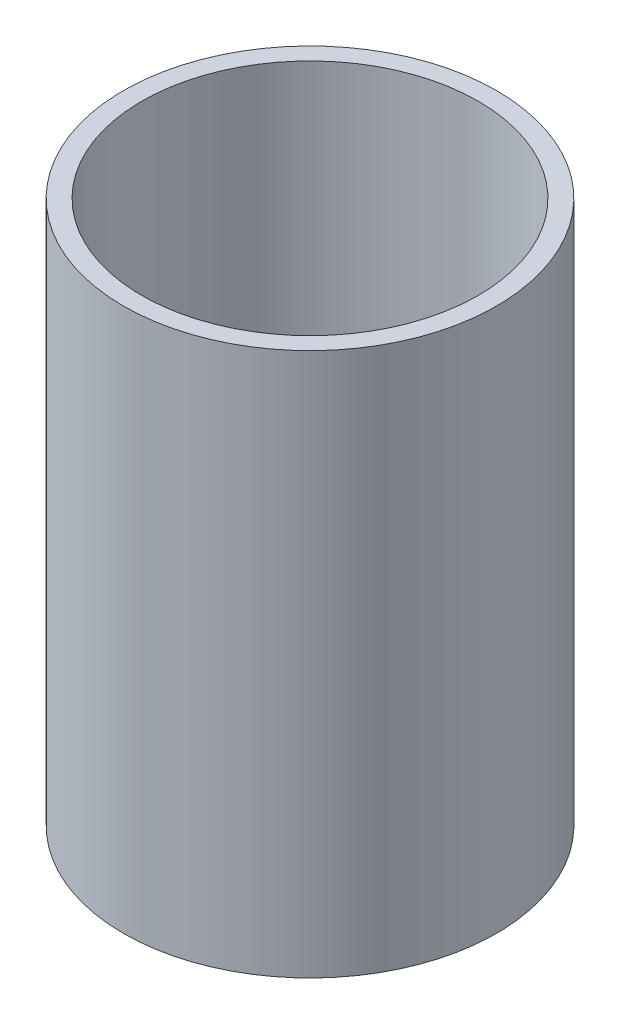
ISO-10303-21;
HEADER;
FILE_DESCRIPTION(('STEP AP214'),'2;1');
FILE_NAME('part.step','',(''),(''),'','','');
FILE_SCHEMA(('AUTOMOTIVE_DESIGN { 1 0 10303 214 1 1 1 1 }'));
ENDSEC;
DATA;
#1=APPLICATION_CONTEXT('core data for automotive mechanical design processes');
#2=APPLICATION_PROTOCOL_DEFINITION('international standard','automotive_design',2000,#1);
#3=PRODUCT_CONTEXT('',#1,'mechanical');
#4=PRODUCT('Part','Part','',(#3));
#5=PRODUCT_RELATED_PRODUCT_CATEGORY('part','',(#4));
#6=PRODUCT_DEFINITION_FORMATION('','',#4);
#7=PRODUCT_DEFINITION_CONTEXT('part definition',#1,'design');
#8=PRODUCT_DEFINITION('design','',#6,#7);
#9=PRODUCT_DEFINITION_SHAPE('','',#8);
#10=(LENGTH_UNIT() NAMED_UNIT(*) SI_UNIT(.MILLI.,.METRE.));
#11=(NAMED_UNIT(*) PLANE_ANGLE_UNIT() SI_UNIT($,.RADIAN.));
#12=(NAMED_UNIT(*) SI_UNIT($,.STERADIAN.) SOLID_ANGLE_UNIT());
#13=UNCERTAINTY_MEASURE_WITH_UNIT(LENGTH_MEASURE(1.E-05),#10,'distance_accuracy_value','');
#14=(GEOMETRIC_REPRESENTATION_CONTEXT(3) GLOBAL_UNCERTAINTY_ASSIGNED_CONTEXT((#13)) GLOBAL_UNIT_ASSIGNED_CONTEXT((#10,
#11,#12)) REPRESENTATION_CONTEXT('',''));
#15=CARTESIAN_POINT('',(0.,0.,0.));
#16=DIRECTION('',(0.,0.,1.));
#17=DIRECTION('',(1.,0.,0.));
#18=AXIS2_PLACEMENT_3D('',#15,#16,#17);
#19=CARTESIAN_POINT('',(0.,123.750590232617,0.));
#20=DIRECTION('',(0.,-1.,0.));
#21=DIRECTION('',(0.,0.,-1.));
#22=AXIS2_PLACEMENT_3D('',#19,#20,#21);
#23=CYLINDRICAL_SURFACE('',#22,42.5);
#24=CARTESIAN_POINT('',(0.,123.750590232617,0.));
#25=DIRECTION('',(0.,1.,0.));
#26=DIRECTION('',(0.,0.,1.));
#27=AXIS2_PLACEMENT_3D('',#24,#25,#26);
#28=CIRCLE('',#27,42.5);
#29=CARTESIAN_POINT('',(0.,123.750590232617,-42.5));
#30=VERTEX_POINT('',#29);
#31=EDGE_CURVE('E10',#30,#30,#28,.T.);
#32=CARTESIAN_POINT('',(0.,0.,0.));
#33=DIRECTION('',(0.,1.,0.));
#34=DIRECTION('',(0.,0.,1.));
#35=AXIS2_PLACEMENT_3D('',#32,#33,#34);
#36=CIRCLE('',#35,42.5);
#37=CARTESIAN_POINT('',(0.,0.,-42.5));
#38=VERTEX_POINT('',#37);
#39=EDGE_CURVE('E37',#38,#38,#36,.T.);
#40=CARTESIAN_POINT('',(0.,123.750590232617,-42.5));
#41=CARTESIAN_POINT('',(0.,122.461521584361,-42.5));
#42=CARTESIAN_POINT('',(0.,121.172452936104,-42.5));
#43=CARTESIAN_POINT('',(0.,118.594315639591,-42.5));
#44=CARTESIAN_POINT('',(0.,117.305246991335,-42.5));
#45=CARTESIAN_POINT('',(0.,114.727109694822,-42.5));
#46=CARTESIAN_POINT('',(0.,113.438041046566,-42.5));
#47=CARTESIAN_POINT('',(0.,110.859903750053,-42.5));
#48=CARTESIAN_POINT('',(0.,109.570835101796,-42.5));
#49=CARTESIAN_POINT('',(0.,106.992697805284,-42.5));
#50=CARTESIAN_POINT('',(0.,105.703629157027,-42.5));
#51=CARTESIAN_POINT('',(0.,103.125491860514,-42.5));
#52=CARTESIAN_POINT('',(0.,101.836423212258,-42.5));
#53=CARTESIAN_POINT('',(0.,99.258285915745,-42.5));
#54=CARTESIAN_POINT('',(0.,97.9692172674885,-42.5));
#55=CARTESIAN_POINT('',(0.,95.3910799709757,-42.5));
#56=CARTESIAN_POINT('',(0.,94.1020113227192,-42.5));
#57=CARTESIAN_POINT('',(0.,91.5238740262064,-42.5));
#58=CARTESIAN_POINT('',(0.,90.23480537795,-42.5));
#59=CARTESIAN_POINT('',(0.,87.6566680814371,-42.5));
#60=CARTESIAN_POINT('',(0.,86.3675994331807,-42.5));
#61=CARTESIAN_POINT('',(0.,83.7894621366678,-42.5));
#62=CARTESIAN_POINT('',(0.,82.5003934884114,-42.5));
#63=CARTESIAN_POINT('',(0.,79.9222561918986,-42.5));
#64=CARTESIAN_POINT('',(0.,78.6331875436421,-42.5));
#65=CARTESIAN_POINT('',(0.,76.0550502471293,-42.5));
#66=CARTESIAN_POINT('',(0.,74.7659815988728,-42.5));
#67=CARTESIAN_POINT('',(0.,72.18784430236,-42.5));
#68=CARTESIAN_POINT('',(0.,70.8987756541035,-42.5));
#69=CARTESIAN_POINT('',(0.,68.3206383575907,-42.5));
#70=CARTESIAN_POINT('',(0.,67.0315697093343,-42.5));
#71=CARTESIAN_POINT('',(0.,64.4534324128214,-42.5));
#72=CARTESIAN_POINT('',(0.,63.164363764565,-42.5));
#73=CARTESIAN_POINT('',(0.,60.5862264680521,-42.5));
#74=CARTESIAN_POINT('',(0.,59.2971578197957,-42.5));
#75=CARTESIAN_POINT('',(0.,56.7190205232828,-42.5));
#76=CARTESIAN_POINT('',(0.,55.4299518750264,-42.5));
#77=CARTESIAN_POINT('',(0.,52.8518145785136,-42.5));
#78=CARTESIAN_POINT('',(0.,51.5627459302571,-42.5));
#79=CARTESIAN_POINT('',(0.,48.9846086337443,-42.5));
#80=CARTESIAN_POINT('',(0.,47.6955399854878,-42.5));
#81=CARTESIAN_POINT('',(0.,45.117402688975,-42.5));
#82=CARTESIAN_POINT('',(0.,43.8283340407186,-42.5));
#83=CARTESIAN_POINT('',(0.,41.2501967442057,-42.5));
#84=CARTESIAN_POINT('',(0.,39.9611280959493,-42.5));
#85=CARTESIAN_POINT('',(0.,37.3829907994364,-42.5));
#86=CARTESIAN_POINT('',(0.,36.09392215118,-42.5));
#87=CARTESIAN_POINT('',(0.,33.5157848546671,-42.5));
#88=CARTESIAN_POINT('',(0.,32.2267162064107,-42.5));
#89=CARTESIAN_POINT('',(0.,29.6485789098979,-42.5));
#90=CARTESIAN_POINT('',(0.,28.3595102616414,-42.5));
#91=CARTESIAN_POINT('',(0.,25.7813729651286,-42.5));
#92=CARTESIAN_POINT('',(0.,24.4923043168721,-42.5));
#93=CARTESIAN_POINT('',(0.,21.9141670203593,-42.5));
#94=CARTESIAN_POINT('',(0.,20.6250983721028,-42.5));
#95=CARTESIAN_POINT('',(0.,18.04696107559,-42.5));
#96=CARTESIAN_POINT('',(0.,16.7578924273336,-42.5));
#97=CARTESIAN_POINT('',(0.,14.1797551308207,-42.5));
#98=CARTESIAN_POINT('',(0.,12.8906864825643,-42.5));
#99=CARTESIAN_POINT('',(0.,10.3125491860514,-42.5));
#100=CARTESIAN_POINT('',(0.,9.023480537795,-42.5));
#101=CARTESIAN_POINT('',(0.,6.44534324128214,-42.5));
#102=CARTESIAN_POINT('',(0.,5.15627459302571,-42.5));
#103=CARTESIAN_POINT('',(0.,2.57813729651286,-42.5));
#104=CARTESIAN_POINT('',(0.,1.28906864825643,-42.5));
#105=CARTESIAN_POINT('',(0.,0.,-42.5));
#106=B_SPLINE_CURVE_WITH_KNOTS('',3,(#40,#41,#42,#43,#44,#45,#46,#47,#48,#49,#50,#51,#52,#53,
#54,#55,#56,#57,#58,#59,#60,#61,#62,#63,#64,#65,#66,#67,#68,#69,#70,#71,#72,#73,#74,#75,#76,#77,
#78,#79,#80,#81,#82,#83,#84,#85,#86,#87,#88,#89,#90,#91,#92,#93,#94,#95,#96,#97,#98,#99,#100,
#101,#102,#103,#104,#105),.UNSPECIFIED.,.F.,.F.,(4,2,2,2,2,2,2,2,2,2,2,2,2,2,2,2,2,2,2,2,2,2,2,
2,2,2,2,2,2,2,2,2,4),(0.,3.86720594476929,7.73441188953858,11.6016178343079,15.4688237790771,
19.3360297238464,23.2032356686157,27.070441613385,30.9376475581543,34.8048535029236,
38.6720594476929,42.5392653924621,46.4064713372314,50.2736772820007,54.14088322677,
58.0080891715393,61.8752951163086,65.7425010610778,69.6097070058471,73.4769129506164,
77.3441188953857,81.211324840155,85.0785307849243,88.9457367296935,92.8129426744628,
96.6801486192321,100.547354564001,104.414560508771,108.28176645354,112.148972398309,
116.016178343079,119.883384287848,123.750590232617),.UNSPECIFIED.);
#107=EDGE_CURVE('BSEAM40',#30,#38,#106,.T.);
#108=ORIENTED_EDGE('',*,*,#31,.F.);
#109=ORIENTED_EDGE('',*,*,#39,.T.);
#110=ORIENTED_EDGE('',*,*,#107,.T.);
#111=ORIENTED_EDGE('',*,*,#107,.F.);
#112=EDGE_LOOP('',(#108,#110,#109,#111));
#113=FACE_BOUND('',#112,.T.);
#114=ADVANCED_FACE('F40',(#113),#23,.T.);
#115=CARTESIAN_POINT('',(0.,123.750590232617,0.));
#116=DIRECTION('',(0.,1.,0.));
#117=DIRECTION('',(0.,0.,1.));
#118=AXIS2_PLACEMENT_3D('',#115,#116,#117);
#119=PLANE('',#118);
#120=CARTESIAN_POINT('',(0.,123.750590232617,0.));
#121=DIRECTION('',(0.,1.,0.));
#122=DIRECTION('',(0.,0.,1.));
#123=AXIS2_PLACEMENT_3D('',#120,#121,#122);
#124=CIRCLE('',#123,38.3263408892088);
#125=CARTESIAN_POINT('',(0.,123.750590232617,-38.3263408892088));
#126=VERTEX_POINT('',#125);
#127=EDGE_CURVE('E50',#126,#126,#124,.T.);
#128=ORIENTED_EDGE('',*,*,#127,.F.);
#129=EDGE_LOOP('',(#128));
#130=FACE_BOUND('',#129,.T.);
#131=ORIENTED_EDGE('',*,*,#31,.T.);
#132=EDGE_LOOP('',(#131));
#133=FACE_BOUND('',#132,.T.);
#134=ADVANCED_FACE('F59',(#130,#133),#119,.T.);
#135=CARTESIAN_POINT('',(0.,0.,0.));
#136=DIRECTION('',(0.,1.,0.));
#137=DIRECTION('',(0.,0.,1.));
#138=AXIS2_PLACEMENT_3D('',#135,#136,#137);
#139=PLANE('',#138);
#140=CARTESIAN_POINT('',(0.,0.,0.));
#141=DIRECTION('',(0.,1.,0.));
#142=DIRECTION('',(0.,0.,1.));
#143=AXIS2_PLACEMENT_3D('',#140,#141,#142);
#144=CIRCLE('',#143,38.3263408892088);
#145=CARTESIAN_POINT('',(0.,0.,-38.3263408892088));
#146=VERTEX_POINT('',#145);
#147=EDGE_CURVE('E47',#146,#146,#144,.T.);
#148=ORIENTED_EDGE('',*,*,#147,.T.);
#149=EDGE_LOOP('',(#148));
#150=FACE_BOUND('',#149,.T.);
#151=ORIENTED_EDGE('',*,*,#39,.F.);
#152=EDGE_LOOP('',(#151));
#153=FACE_BOUND('',#152,.T.);
#154=ADVANCED_FACE('F58',(#150,#153),#139,.F.);
#155=CARTESIAN_POINT('',(0.,123.750590232617,0.));
#156=DIRECTION('',(0.,-1.,0.));
#157=DIRECTION('',(0.,0.,-1.));
#158=AXIS2_PLACEMENT_3D('',#155,#156,#157);
#159=CYLINDRICAL_SURFACE('',#158,38.3263408892088);
#160=CARTESIAN_POINT('',(0.,123.750590232617,-38.3263408892088));
#161=CARTESIAN_POINT('',(0.,122.461521584361,-38.3263408892088));
#162=CARTESIAN_POINT('',(0.,121.172452936104,-38.3263408892088));
#163=CARTESIAN_POINT('',(0.,118.594315639591,-38.3263408892088));
#164=CARTESIAN_POINT('',(0.,117.305246991335,-38.3263408892088));
#165=CARTESIAN_POINT('',(0.,114.727109694822,-38.3263408892088));
#166=CARTESIAN_POINT('',(0.,113.438041046566,-38.3263408892088));
#167=CARTESIAN_POINT('',(0.,110.859903750053,-38.3263408892088));
#168=CARTESIAN_POINT('',(0.,109.570835101796,-38.3263408892088));
#169=CARTESIAN_POINT('',(0.,106.992697805284,-38.3263408892088));
#170=CARTESIAN_POINT('',(0.,105.703629157027,-38.3263408892088));
#171=CARTESIAN_POINT('',(0.,103.125491860514,-38.3263408892088));
#172=CARTESIAN_POINT('',(0.,101.836423212258,-38.3263408892088));
#173=CARTESIAN_POINT('',(0.,99.258285915745,-38.3263408892088));
#174=CARTESIAN_POINT('',(0.,97.9692172674885,-38.3263408892088));
#175=CARTESIAN_POINT('',(0.,95.3910799709757,-38.3263408892088));
#176=CARTESIAN_POINT('',(0.,94.1020113227192,-38.3263408892088));
#177=CARTESIAN_POINT('',(0.,91.5238740262064,-38.3263408892088));
#178=CARTESIAN_POINT('',(0.,90.23480537795,-38.3263408892088));
#179=CARTESIAN_POINT('',(0.,87.6566680814371,-38.3263408892088));
#180=CARTESIAN_POINT('',(0.,86.3675994331807,-38.3263408892088));
#181=CARTESIAN_POINT('',(0.,83.7894621366678,-38.3263408892088));
#182=CARTESIAN_POINT('',(0.,82.5003934884114,-38.3263408892088));
#183=CARTESIAN_POINT('',(0.,79.9222561918986,-38.3263408892088));
#184=CARTESIAN_POINT('',(0.,78.6331875436421,-38.3263408892088));
#185=CARTESIAN_POINT('',(0.,76.0550502471293,-38.3263408892088));
#186=CARTESIAN_POINT('',(0.,74.7659815988728,-38.3263408892088));
#187=CARTESIAN_POINT('',(0.,72.18784430236,-38.3263408892088));
#188=CARTESIAN_POINT('',(0.,70.8987756541035,-38.3263408892088));
#189=CARTESIAN_POINT('',(0.,68.3206383575907,-38.3263408892088));
#190=CARTESIAN_POINT('',(0.,67.0315697093343,-38.3263408892088));
#191=CARTESIAN_POINT('',(0.,64.4534324128214,-38.3263408892088));
#192=CARTESIAN_POINT('',(0.,63.164363764565,-38.3263408892088));
#193=CARTESIAN_POINT('',(0.,60.5862264680521,-38.3263408892088));
#194=CARTESIAN_POINT('',(0.,59.2971578197957,-38.3263408892088));
#195=CARTESIAN_POINT('',(0.,56.7190205232828,-38.3263408892088));
#196=CARTESIAN_POINT('',(0.,55.4299518750264,-38.3263408892088));
#197=CARTESIAN_POINT('',(0.,52.8518145785136,-38.3263408892088));
#198=CARTESIAN_POINT('',(0.,51.5627459302571,-38.3263408892088));
#199=CARTESIAN_POINT('',(0.,48.9846086337443,-38.3263408892088));
#200=CARTESIAN_POINT('',(0.,47.6955399854878,-38.3263408892088));
#201=CARTESIAN_POINT('',(0.,45.117402688975,-38.3263408892088));
#202=CARTESIAN_POINT('',(0.,43.8283340407186,-38.3263408892088));
#203=CARTESIAN_POINT('',(0.,41.2501967442057,-38.3263408892088));
#204=CARTESIAN_POINT('',(0.,39.9611280959493,-38.3263408892088));
#205=CARTESIAN_POINT('',(0.,37.3829907994364,-38.3263408892088));
#206=CARTESIAN_POINT('',(0.,36.09392215118,-38.3263408892088));
#207=CARTESIAN_POINT('',(0.,33.5157848546671,-38.3263408892088));
#208=CARTESIAN_POINT('',(0.,32.2267162064107,-38.3263408892088));
#209=CARTESIAN_POINT('',(0.,29.6485789098978,-38.3263408892088));
#210=CARTESIAN_POINT('',(0.,28.3595102616414,-38.3263408892088));
#211=CARTESIAN_POINT('',(0.,25.7813729651286,-38.3263408892088));
#212=CARTESIAN_POINT('',(0.,24.4923043168721,-38.3263408892088));
#213=CARTESIAN_POINT('',(0.,21.9141670203593,-38.3263408892088));
#214=CARTESIAN_POINT('',(0.,20.6250983721028,-38.3263408892088));
#215=CARTESIAN_POINT('',(0.,18.04696107559,-38.3263408892088));
#216=CARTESIAN_POINT('',(0.,16.7578924273336,-38.3263408892088));
#217=CARTESIAN_POINT('',(0.,14.1797551308207,-38.3263408892088));
#218=CARTESIAN_POINT('',(0.,12.8906864825643,-38.3263408892088));
#219=CARTESIAN_POINT('',(0.,10.3125491860514,-38.3263408892088));
#220=CARTESIAN_POINT('',(0.,9.023480537795,-38.3263408892088));
#221=CARTESIAN_POINT('',(0.,6.44534324128214,-38.3263408892088));
#222=CARTESIAN_POINT('',(0.,5.15627459302571,-38.3263408892088));
#223=CARTESIAN_POINT('',(0.,2.57813729651286,-38.3263408892088));
#224=CARTESIAN_POINT('',(0.,1.28906864825643,-38.3263408892088));
#225=CARTESIAN_POINT('',(0.,0.,-38.3263408892088));
#226=B_SPLINE_CURVE_WITH_KNOTS('',3,(#160,#161,#162,#163,#164,#165,#166,#167,#168,#169,#170,
#171,#172,#173,#174,#175,#176,#177,#178,#179,#180,#181,#182,#183,#184,#185,#186,#187,#188,#189,
#190,#191,#192,#193,#194,#195,#196,#197,#198,#199,#200,#201,#202,#203,#204,#205,#206,#207,#208,
#209,#210,#211,#212,#213,#214,#215,#216,#217,#218,#219,#220,#221,#222,#223,#224,#225),
.UNSPECIFIED.,.F.,.F.,(4,2,2,2,2,2,2,2,2,2,2,2,2,2,2,2,2,2,2,2,2,2,2,2,2,2,2,2,2,2,2,2,4),(0.,
3.86720594476928,7.73441188953856,11.6016178343078,15.4688237790771,19.3360297238464,
23.2032356686157,27.070441613385,30.9376475581543,34.8048535029235,38.6720594476928,
42.5392653924621,46.4064713372314,50.2736772820007,54.14088322677,58.0080891715393,
61.8752951163085,65.7425010610778,69.6097070058471,73.4769129506164,77.3441188953857,
81.211324840155,85.0785307849242,88.9457367296935,92.8129426744628,96.6801486192321,
100.547354564001,104.414560508771,108.28176645354,112.148972398309,116.016178343079,
119.883384287848,123.750590232617),.UNSPECIFIED.);
#227=EDGE_CURVE('BSEAM54',#126,#146,#226,.T.);
#228=ORIENTED_EDGE('',*,*,#127,.T.);
#229=ORIENTED_EDGE('',*,*,#147,.F.);
#230=ORIENTED_EDGE('',*,*,#227,.T.);
#231=ORIENTED_EDGE('',*,*,#227,.F.);
#232=EDGE_LOOP('',(#228,#230,#229,#231));
#233=FACE_BOUND('',#232,.T.);
#234=ADVANCED_FACE('F54',(#233),#159,.F.);
#235=CLOSED_SHELL('',(#114,#134,#154,#234));
#236=MANIFOLD_SOLID_BREP('B2',#235);
#237=ADVANCED_BREP_SHAPE_REPRESENTATION('',(#18,#236),#14);
#238=SHAPE_DEFINITION_REPRESENTATION(#9,#237);
ENDSEC;
END-ISO-10303-21;
